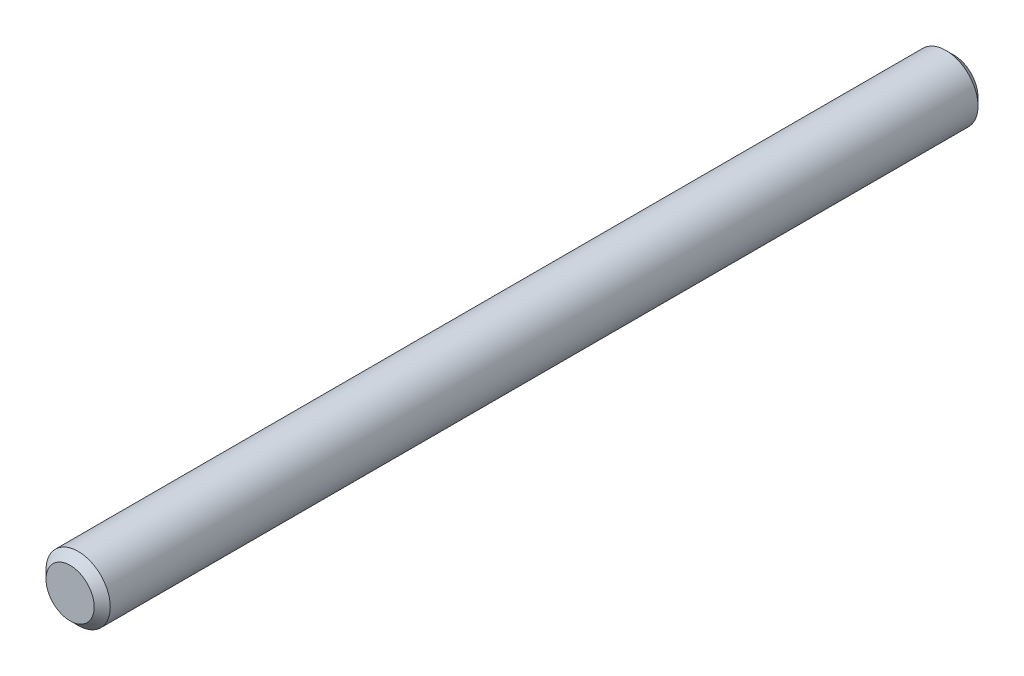
ISO-10303-21;
HEADER;
FILE_DESCRIPTION(('STEP AP214'),'2;1');
FILE_NAME('part.step','',(''),(''),'','','');
FILE_SCHEMA(('AUTOMOTIVE_DESIGN { 1 0 10303 214 1 1 1 1 }'));
ENDSEC;
DATA;
#1=APPLICATION_CONTEXT('core data for automotive mechanical design processes');
#2=APPLICATION_PROTOCOL_DEFINITION('international standard','automotive_design',2000,#1);
#3=PRODUCT_CONTEXT('',#1,'mechanical');
#4=PRODUCT('Part','Part','',(#3));
#5=PRODUCT_RELATED_PRODUCT_CATEGORY('part','',(#4));
#6=PRODUCT_DEFINITION_FORMATION('','',#4);
#7=PRODUCT_DEFINITION_CONTEXT('part definition',#1,'design');
#8=PRODUCT_DEFINITION('design','',#6,#7);
#9=PRODUCT_DEFINITION_SHAPE('','',#8);
#10=(LENGTH_UNIT() NAMED_UNIT(*) SI_UNIT(.MILLI.,.METRE.));
#11=(NAMED_UNIT(*) PLANE_ANGLE_UNIT() SI_UNIT($,.RADIAN.));
#12=(NAMED_UNIT(*) SI_UNIT($,.STERADIAN.) SOLID_ANGLE_UNIT());
#13=UNCERTAINTY_MEASURE_WITH_UNIT(LENGTH_MEASURE(1.E-05),#10,'distance_accuracy_value','');
#14=(GEOMETRIC_REPRESENTATION_CONTEXT(3) GLOBAL_UNCERTAINTY_ASSIGNED_CONTEXT((#13)) GLOBAL_UNIT_ASSIGNED_CONTEXT((#10,
#11,#12)) REPRESENTATION_CONTEXT('',''));
#15=CARTESIAN_POINT('',(0.,0.,0.));
#16=DIRECTION('',(0.,0.,1.));
#17=DIRECTION('',(1.,0.,0.));
#18=AXIS2_PLACEMENT_3D('',#15,#16,#17);
#19=CARTESIAN_POINT('',(0.,0.,11.));
#20=DIRECTION('',(0.,0.,-1.));
#21=DIRECTION('',(-1.,0.,0.));
#22=AXIS2_PLACEMENT_3D('',#19,#20,#21);
#23=CYLINDRICAL_SURFACE('',#22,0.4);
#24=CARTESIAN_POINT('',(0.,0.,0.100000000000001));
#25=DIRECTION('',(0.,0.,1.));
#26=DIRECTION('',(1.,0.,0.));
#27=AXIS2_PLACEMENT_3D('',#24,#25,#26);
#28=CIRCLE('',#27,0.4);
#29=CARTESIAN_POINT('',(0.4,0.,0.100000000000001));
#30=VERTEX_POINT('',#29);
#31=EDGE_CURVE('E43',#30,#30,#28,.T.);
#32=ORIENTED_EDGE('',*,*,#31,.T.);
#33=EDGE_LOOP('',(#32));
#34=FACE_BOUND('',#33,.T.);
#35=CARTESIAN_POINT('',(0.,0.,10.9));
#36=DIRECTION('',(0.,0.,1.));
#37=DIRECTION('',(1.,0.,0.));
#38=AXIS2_PLACEMENT_3D('',#35,#36,#37);
#39=CIRCLE('',#38,0.4);
#40=CARTESIAN_POINT('',(0.4,0.,10.9));
#41=VERTEX_POINT('',#40);
#42=EDGE_CURVE('E47',#41,#41,#39,.F.);
#43=ORIENTED_EDGE('',*,*,#42,.T.);
#44=EDGE_LOOP('',(#43));
#45=FACE_BOUND('',#44,.T.);
#46=ADVANCED_FACE('F32',(#34,#45),#23,.T.);
#47=CARTESIAN_POINT('',(0.,0.,11.));
#48=DIRECTION('',(0.,0.,1.));
#49=DIRECTION('',(1.,0.,0.));
#50=AXIS2_PLACEMENT_3D('',#47,#48,#49);
#51=PLANE('',#50);
#52=CARTESIAN_POINT('',(0.,0.,11.));
#53=DIRECTION('',(0.,0.,1.));
#54=DIRECTION('',(1.,0.,0.));
#55=AXIS2_PLACEMENT_3D('',#52,#53,#54);
#56=CIRCLE('',#55,0.299999999999998);
#57=CARTESIAN_POINT('',(0.299999999999998,0.,11.));
#58=VERTEX_POINT('',#57);
#59=EDGE_CURVE('E10',#58,#58,#56,.T.);
#60=ORIENTED_EDGE('',*,*,#59,.T.);
#61=EDGE_LOOP('',(#60));
#62=FACE_BOUND('',#61,.T.);
#63=ADVANCED_FACE('F63',(#62),#51,.T.);
#64=CARTESIAN_POINT('',(0.,0.,0.));
#65=DIRECTION('',(0.,0.,1.));
#66=DIRECTION('',(1.,0.,0.));
#67=AXIS2_PLACEMENT_3D('',#64,#65,#66);
#68=PLANE('',#67);
#69=CARTESIAN_POINT('',(0.,0.,0.));
#70=DIRECTION('',(0.,0.,1.));
#71=DIRECTION('',(1.,0.,0.));
#72=AXIS2_PLACEMENT_3D('',#69,#70,#71);
#73=CIRCLE('',#72,0.299999999999998);
#74=CARTESIAN_POINT('',(0.299999999999998,0.,0.));
#75=VERTEX_POINT('',#74);
#76=EDGE_CURVE('E39',#75,#75,#73,.F.);
#77=ORIENTED_EDGE('',*,*,#76,.T.);
#78=EDGE_LOOP('',(#77));
#79=FACE_BOUND('',#78,.T.);
#80=ADVANCED_FACE('F60',(#79),#68,.F.);
#81=CARTESIAN_POINT('',(0.,0.,0.100000000000001));
#82=DIRECTION('',(0.,0.,1.));
#83=DIRECTION('',(1.,0.,0.));
#84=AXIS2_PLACEMENT_3D('',#81,#82,#83);
#85=CONICAL_SURFACE('',#84,0.4,0.785398163397452);
#86=ORIENTED_EDGE('',*,*,#76,.F.);
#87=EDGE_LOOP('',(#86));
#88=FACE_BOUND('',#87,.T.);
#89=ORIENTED_EDGE('',*,*,#31,.F.);
#90=EDGE_LOOP('',(#89));
#91=FACE_BOUND('',#90,.T.);
#92=ADVANCED_FACE('F56',(#88,#91),#85,.T.);
#93=CARTESIAN_POINT('',(0.,0.,11.));
#94=DIRECTION('',(0.,0.,-1.));
#95=DIRECTION('',(-1.,0.,0.));
#96=AXIS2_PLACEMENT_3D('',#93,#94,#95);
#97=CONICAL_SURFACE('',#96,0.299999999999998,0.785398163397452);
#98=ORIENTED_EDGE('',*,*,#42,.F.);
#99=EDGE_LOOP('',(#98));
#100=FACE_BOUND('',#99,.T.);
#101=ORIENTED_EDGE('',*,*,#59,.F.);
#102=EDGE_LOOP('',(#101));
#103=FACE_BOUND('',#102,.T.);
#104=ADVANCED_FACE('F34',(#100,#103),#97,.T.);
#105=CLOSED_SHELL('',(#46,#63,#80,#92,#104));
#106=MANIFOLD_SOLID_BREP('B2',#105);
#107=ADVANCED_BREP_SHAPE_REPRESENTATION('',(#18,#106),#14);
#108=SHAPE_DEFINITION_REPRESENTATION(#9,#107);
ENDSEC;
END-ISO-10303-21;
